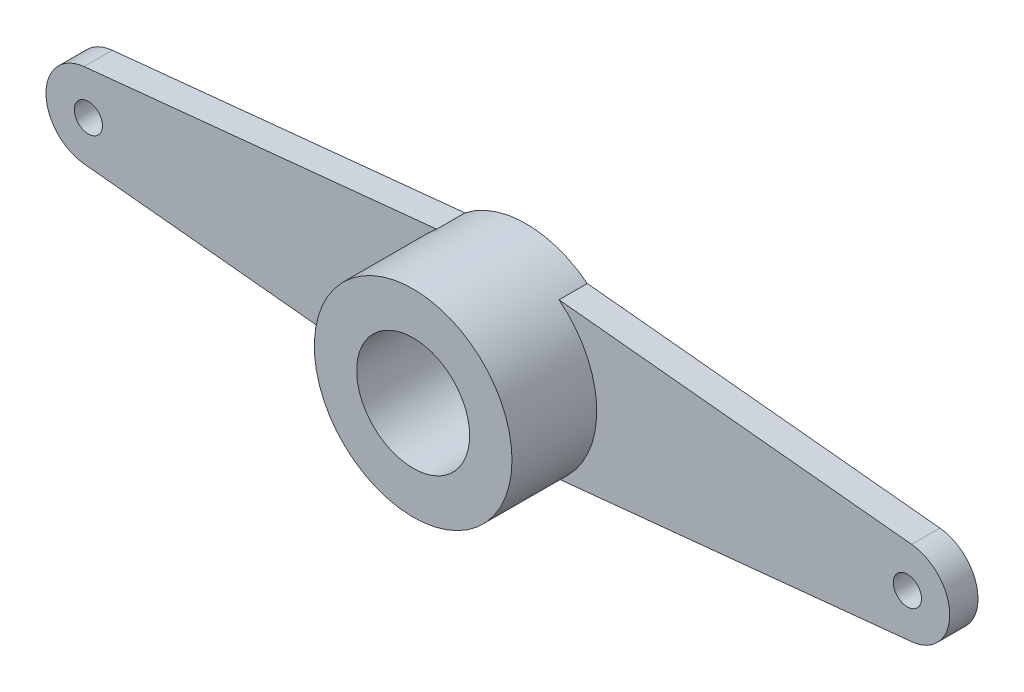
ISO-10303-21;
HEADER;
FILE_DESCRIPTION(('STEP AP214'),'2;1');
FILE_NAME('part.step','',(''),(''),'','','');
FILE_SCHEMA(('AUTOMOTIVE_DESIGN { 1 0 10303 214 1 1 1 1 }'));
ENDSEC;
DATA;
#1=APPLICATION_CONTEXT('core data for automotive mechanical design processes');
#2=APPLICATION_PROTOCOL_DEFINITION('international standard','automotive_design',2000,#1);
#3=PRODUCT_CONTEXT('',#1,'mechanical');
#4=PRODUCT('Part','Part','',(#3));
#5=PRODUCT_RELATED_PRODUCT_CATEGORY('part','',(#4));
#6=PRODUCT_DEFINITION_FORMATION('','',#4);
#7=PRODUCT_DEFINITION_CONTEXT('part definition',#1,'design');
#8=PRODUCT_DEFINITION('design','',#6,#7);
#9=PRODUCT_DEFINITION_SHAPE('','',#8);
#10=(LENGTH_UNIT() NAMED_UNIT(*) SI_UNIT(.MILLI.,.METRE.));
#11=(NAMED_UNIT(*) PLANE_ANGLE_UNIT() SI_UNIT($,.RADIAN.));
#12=(NAMED_UNIT(*) SI_UNIT($,.STERADIAN.) SOLID_ANGLE_UNIT());
#13=UNCERTAINTY_MEASURE_WITH_UNIT(LENGTH_MEASURE(1.E-05),#10,'distance_accuracy_value','');
#14=(GEOMETRIC_REPRESENTATION_CONTEXT(3) GLOBAL_UNCERTAINTY_ASSIGNED_CONTEXT((#13)) GLOBAL_UNIT_ASSIGNED_CONTEXT((#10,
#11,#12)) REPRESENTATION_CONTEXT('',''));
#15=CARTESIAN_POINT('',(0.,0.,0.));
#16=DIRECTION('',(0.,0.,1.));
#17=DIRECTION('',(1.,0.,0.));
#18=AXIS2_PLACEMENT_3D('',#15,#16,#17);
#19=CARTESIAN_POINT('',(0.295950270276392,-2.93826247582225,1.));
#20=DIRECTION('',(-0.100215817025014,0.994965723036733,0.));
#21=DIRECTION('',(-0.994965723036733,-0.100215817025014,0.));
#22=AXIS2_PLACEMENT_3D('',#19,#20,#21);
#23=PLANE('',#22);
#24=DIRECTION('',(0.994965723036733,0.100215817025014,0.));
#25=VECTOR('',#24,1.);
#26=CARTESIAN_POINT('',(0.295950270276392,-2.93826247582225,0.));
#27=LINE('',#26,#25);
#28=CARTESIAN_POINT('',(2.1650635094611,-2.75,0.));
#29=VERTEX_POINT('',#28);
#30=CARTESIAN_POINT('',(14.6503237255375,-1.4924485845551,0.));
#31=VERTEX_POINT('',#30);
#32=EDGE_CURVE('E144',#29,#31,#27,.T.);
#33=ORIENTED_EDGE('',*,*,#32,.T.);
#34=DIRECTION('',(0.,0.,-1.));
#35=VECTOR('',#34,1.);
#36=CARTESIAN_POINT('',(14.6503237255375,-1.4924485845551,1.));
#37=LINE('',#36,#35);
#38=CARTESIAN_POINT('',(14.6503237255375,-1.4924485845551,1.));
#39=VERTEX_POINT('',#38);
#40=EDGE_CURVE('E147',#39,#31,#37,.T.);
#41=ORIENTED_EDGE('',*,*,#40,.F.);
#42=DIRECTION('',(0.994965723036733,0.100215817025014,0.));
#43=VECTOR('',#42,1.);
#44=CARTESIAN_POINT('',(0.295950270276392,-2.93826247582225,1.));
#45=LINE('',#44,#43);
#46=CARTESIAN_POINT('',(2.1650635094611,-2.75,1.));
#47=VERTEX_POINT('',#46);
#48=EDGE_CURVE('E148',#47,#39,#45,.T.);
#49=ORIENTED_EDGE('',*,*,#48,.F.);
#50=DIRECTION('',(0.,0.,-1.));
#51=VECTOR('',#50,1.);
#52=CARTESIAN_POINT('',(2.1650635094611,-2.75,1.));
#53=LINE('',#52,#51);
#54=EDGE_CURVE('E160',#47,#29,#53,.T.);
#55=ORIENTED_EDGE('',*,*,#54,.T.);
#56=EDGE_LOOP('',(#33,#41,#49,#55));
#57=FACE_BOUND('',#56,.T.);
#58=ADVANCED_FACE('F37',(#57),#23,.F.);
#59=CARTESIAN_POINT('',(14.5,0.,1.));
#60=DIRECTION('',(0.,0.,-1.));
#61=DIRECTION('',(-1.,0.,0.));
#62=AXIS2_PLACEMENT_3D('',#59,#60,#61);
#63=CYLINDRICAL_SURFACE('',#62,1.5);
#64=CARTESIAN_POINT('',(14.5,0.,0.));
#65=DIRECTION('',(0.,0.,1.));
#66=DIRECTION('',(1.,0.,0.));
#67=AXIS2_PLACEMENT_3D('',#64,#65,#66);
#68=CIRCLE('',#67,1.5);
#69=CARTESIAN_POINT('',(14.6503237255375,1.4924485845551,0.));
#70=VERTEX_POINT('',#69);
#71=EDGE_CURVE('E163',#31,#70,#68,.T.);
#72=ORIENTED_EDGE('',*,*,#71,.T.);
#73=DIRECTION('',(0.,0.,-1.));
#74=VECTOR('',#73,1.);
#75=CARTESIAN_POINT('',(14.6503237255375,1.4924485845551,1.));
#76=LINE('',#75,#74);
#77=CARTESIAN_POINT('',(14.6503237255375,1.4924485845551,1.));
#78=VERTEX_POINT('',#77);
#79=EDGE_CURVE('E181',#78,#70,#76,.T.);
#80=ORIENTED_EDGE('',*,*,#79,.F.);
#81=CARTESIAN_POINT('',(14.5,0.,1.));
#82=DIRECTION('',(0.,0.,1.));
#83=DIRECTION('',(1.,0.,0.));
#84=AXIS2_PLACEMENT_3D('',#81,#82,#83);
#85=CIRCLE('',#84,1.5);
#86=EDGE_CURVE('E151',#39,#78,#85,.T.);
#87=ORIENTED_EDGE('',*,*,#86,.F.);
#88=ORIENTED_EDGE('',*,*,#40,.T.);
#89=EDGE_LOOP('',(#72,#80,#87,#88));
#90=FACE_BOUND('',#89,.T.);
#91=ADVANCED_FACE('F185',(#90),#63,.T.);
#92=CARTESIAN_POINT('',(0.295950270276392,2.93826247582225,1.));
#93=DIRECTION('',(0.100215817025014,0.994965723036733,0.));
#94=DIRECTION('',(-0.994965723036733,0.100215817025014,0.));
#95=AXIS2_PLACEMENT_3D('',#92,#93,#94);
#96=PLANE('',#95);
#97=DIRECTION('',(0.994965723036733,-0.100215817025014,0.));
#98=VECTOR('',#97,1.);
#99=CARTESIAN_POINT('',(0.295950270276392,2.93826247582225,0.));
#100=LINE('',#99,#98);
#101=CARTESIAN_POINT('',(2.1650635094611,2.75,0.));
#102=VERTEX_POINT('',#101);
#103=EDGE_CURVE('E166',#102,#70,#100,.T.);
#104=ORIENTED_EDGE('',*,*,#103,.F.);
#105=DIRECTION('',(0.,0.,-1.));
#106=VECTOR('',#105,1.);
#107=CARTESIAN_POINT('',(2.1650635094611,2.75,1.));
#108=LINE('',#107,#106);
#109=CARTESIAN_POINT('',(2.1650635094611,2.75,1.));
#110=VERTEX_POINT('',#109);
#111=EDGE_CURVE('E179',#110,#102,#108,.T.);
#112=ORIENTED_EDGE('',*,*,#111,.F.);
#113=DIRECTION('',(0.994965723036733,-0.100215817025014,0.));
#114=VECTOR('',#113,1.);
#115=CARTESIAN_POINT('',(0.295950270276392,2.93826247582225,1.));
#116=LINE('',#115,#114);
#117=EDGE_CURVE('E154',#110,#78,#116,.T.);
#118=ORIENTED_EDGE('',*,*,#117,.T.);
#119=ORIENTED_EDGE('',*,*,#79,.T.);
#120=EDGE_LOOP('',(#104,#112,#118,#119));
#121=FACE_BOUND('',#120,.T.);
#122=ADVANCED_FACE('F198',(#121),#96,.T.);
#123=CARTESIAN_POINT('',(0.,0.,1.));
#124=DIRECTION('',(0.,0.,-1.));
#125=DIRECTION('',(-1.,0.,0.));
#126=AXIS2_PLACEMENT_3D('',#123,#124,#125);
#127=CYLINDRICAL_SURFACE('',#126,2.);
#128=CARTESIAN_POINT('',(0.,0.,4.));
#129=DIRECTION('',(0.,0.,1.));
#130=DIRECTION('',(1.,0.,0.));
#131=AXIS2_PLACEMENT_3D('',#128,#129,#130);
#132=CIRCLE('',#131,2.);
#133=CARTESIAN_POINT('',(2.,0.,4.));
#134=VERTEX_POINT('',#133);
#135=EDGE_CURVE('E138',#134,#134,#132,.T.);
#136=ORIENTED_EDGE('',*,*,#135,.T.);
#137=EDGE_LOOP('',(#136));
#138=FACE_BOUND('',#137,.T.);
#139=CARTESIAN_POINT('',(0.,0.,0.));
#140=DIRECTION('',(0.,0.,1.));
#141=DIRECTION('',(1.,0.,0.));
#142=AXIS2_PLACEMENT_3D('',#139,#140,#141);
#143=CIRCLE('',#142,2.);
#144=CARTESIAN_POINT('',(2.,0.,0.));
#145=VERTEX_POINT('',#144);
#146=EDGE_CURVE('E172',#145,#145,#143,.T.);
#147=ORIENTED_EDGE('',*,*,#146,.F.);
#148=EDGE_LOOP('',(#147));
#149=FACE_BOUND('',#148,.T.);
#150=ADVANCED_FACE('F225',(#138,#149),#127,.F.);
#151=CARTESIAN_POINT('',(0.,0.,1.));
#152=DIRECTION('',(0.,0.,-1.));
#153=DIRECTION('',(-1.,0.,0.));
#154=AXIS2_PLACEMENT_3D('',#151,#152,#153);
#155=CYLINDRICAL_SURFACE('',#154,3.5);
#156=CARTESIAN_POINT('',(0.,0.,1.));
#157=DIRECTION('',(0.,0.,1.));
#158=DIRECTION('',(1.,0.,0.));
#159=AXIS2_PLACEMENT_3D('',#156,#157,#158);
#160=CIRCLE('',#159,3.5);
#161=CARTESIAN_POINT('',(-2.1650635094611,2.75,1.));
#162=VERTEX_POINT('',#161);
#163=CARTESIAN_POINT('',(-2.1650635094611,-2.75,1.));
#164=VERTEX_POINT('',#163);
#165=EDGE_CURVE('E11',#162,#164,#160,.T.);
#166=ORIENTED_EDGE('',*,*,#165,.T.);
#167=DIRECTION('',(0.,0.,-1.));
#168=VECTOR('',#167,1.);
#169=CARTESIAN_POINT('',(-2.1650635094611,-2.75,1.));
#170=LINE('',#169,#168);
#171=CARTESIAN_POINT('',(-2.1650635094611,-2.75,0.));
#172=VERTEX_POINT('',#171);
#173=EDGE_CURVE('E136',#164,#172,#170,.T.);
#174=ORIENTED_EDGE('',*,*,#173,.T.);
#175=CARTESIAN_POINT('',(0.,0.,0.));
#176=DIRECTION('',(0.,0.,1.));
#177=DIRECTION('',(1.,0.,0.));
#178=AXIS2_PLACEMENT_3D('',#175,#176,#177);
#179=CIRCLE('',#178,3.5);
#180=EDGE_CURVE('E169',#172,#29,#179,.T.);
#181=ORIENTED_EDGE('',*,*,#180,.T.);
#182=ORIENTED_EDGE('',*,*,#54,.F.);
#183=CARTESIAN_POINT('',(0.,0.,1.));
#184=DIRECTION('',(0.,0.,1.));
#185=DIRECTION('',(1.,0.,0.));
#186=AXIS2_PLACEMENT_3D('',#183,#184,#185);
#187=CIRCLE('',#186,3.5);
#188=EDGE_CURVE('E44',#47,#110,#187,.T.);
#189=ORIENTED_EDGE('',*,*,#188,.T.);
#190=ORIENTED_EDGE('',*,*,#111,.T.);
#191=CARTESIAN_POINT('',(-2.1650635094611,2.75,0.));
#192=VERTEX_POINT('',#191);
#193=EDGE_CURVE('E170',#102,#192,#179,.T.);
#194=ORIENTED_EDGE('',*,*,#193,.T.);
#195=DIRECTION('',(0.,0.,-1.));
#196=VECTOR('',#195,1.);
#197=CARTESIAN_POINT('',(-2.1650635094611,2.75,1.));
#198=LINE('',#197,#196);
#199=EDGE_CURVE('E54',#162,#192,#198,.T.);
#200=ORIENTED_EDGE('',*,*,#199,.F.);
#201=EDGE_LOOP('',(#166,#174,#181,#182,#189,#190,#194,#200));
#202=FACE_BOUND('',#201,.T.);
#203=CARTESIAN_POINT('',(0.,0.,4.));
#204=DIRECTION('',(0.,0.,1.));
#205=DIRECTION('',(1.,0.,0.));
#206=AXIS2_PLACEMENT_3D('',#203,#204,#205);
#207=CIRCLE('',#206,3.5);
#208=CARTESIAN_POINT('',(3.5,0.,4.));
#209=VERTEX_POINT('',#208);
#210=EDGE_CURVE('E141',#209,#209,#207,.T.);
#211=ORIENTED_EDGE('',*,*,#210,.F.);
#212=EDGE_LOOP('',(#211));
#213=FACE_BOUND('',#212,.T.);
#214=ADVANCED_FACE('F202',(#202,#213),#155,.T.);
#215=CARTESIAN_POINT('',(14.5,0.,1.));
#216=DIRECTION('',(0.,0.,-1.));
#217=DIRECTION('',(-1.,0.,0.));
#218=AXIS2_PLACEMENT_3D('',#215,#216,#217);
#219=CYLINDRICAL_SURFACE('',#218,0.500000000000001);
#220=CARTESIAN_POINT('',(14.5,0.,1.));
#221=DIRECTION('',(0.,0.,1.));
#222=DIRECTION('',(1.,0.,0.));
#223=AXIS2_PLACEMENT_3D('',#220,#221,#222);
#224=CIRCLE('',#223,0.500000000000001);
#225=CARTESIAN_POINT('',(15.,0.,1.));
#226=VERTEX_POINT('',#225);
#227=EDGE_CURVE('E157',#226,#226,#224,.T.);
#228=ORIENTED_EDGE('',*,*,#227,.T.);
#229=EDGE_LOOP('',(#228));
#230=FACE_BOUND('',#229,.T.);
#231=CARTESIAN_POINT('',(14.5,0.,0.));
#232=DIRECTION('',(0.,0.,1.));
#233=DIRECTION('',(1.,0.,0.));
#234=AXIS2_PLACEMENT_3D('',#231,#232,#233);
#235=CIRCLE('',#234,0.500000000000001);
#236=CARTESIAN_POINT('',(15.,0.,0.));
#237=VERTEX_POINT('',#236);
#238=EDGE_CURVE('E152',#237,#237,#235,.T.);
#239=ORIENTED_EDGE('',*,*,#238,.F.);
#240=EDGE_LOOP('',(#239));
#241=FACE_BOUND('',#240,.T.);
#242=ADVANCED_FACE('F230',(#230,#241),#219,.F.);
#243=CARTESIAN_POINT('',(0.,0.,1.));
#244=DIRECTION('',(0.,0.,1.));
#245=DIRECTION('',(1.,0.,0.));
#246=AXIS2_PLACEMENT_3D('',#243,#244,#245);
#247=PLANE('',#246);
#248=ORIENTED_EDGE('',*,*,#188,.F.);
#249=ORIENTED_EDGE('',*,*,#48,.T.);
#250=ORIENTED_EDGE('',*,*,#86,.T.);
#251=ORIENTED_EDGE('',*,*,#117,.F.);
#252=EDGE_LOOP('',(#248,#249,#250,#251));
#253=FACE_BOUND('',#252,.T.);
#254=ORIENTED_EDGE('',*,*,#227,.F.);
#255=EDGE_LOOP('',(#254));
#256=FACE_BOUND('',#255,.T.);
#257=ADVANCED_FACE('F200',(#253,#256),#247,.T.);
#258=CARTESIAN_POINT('',(0.,0.,0.));
#259=DIRECTION('',(0.,0.,1.));
#260=DIRECTION('',(1.,0.,0.));
#261=AXIS2_PLACEMENT_3D('',#258,#259,#260);
#262=PLANE('',#261);
#263=ORIENTED_EDGE('',*,*,#32,.F.);
#264=ORIENTED_EDGE('',*,*,#180,.F.);
#265=DIRECTION('',(-0.994965723036733,0.100215817025014,0.));
#266=VECTOR('',#265,1.);
#267=CARTESIAN_POINT('',(-0.295950270276392,-2.93826247582225,0.));
#268=LINE('',#267,#266);
#269=CARTESIAN_POINT('',(-14.6503237255375,-1.4924485845551,0.));
#270=VERTEX_POINT('',#269);
#271=EDGE_CURVE('E125',#172,#270,#268,.T.);
#272=ORIENTED_EDGE('',*,*,#271,.T.);
#273=CARTESIAN_POINT('',(-14.5,0.,0.));
#274=DIRECTION('',(0.,0.,-1.));
#275=DIRECTION('',(-1.,0.,0.));
#276=AXIS2_PLACEMENT_3D('',#273,#274,#275);
#277=CIRCLE('',#276,1.5);
#278=CARTESIAN_POINT('',(-14.6503237255375,1.4924485845551,0.));
#279=VERTEX_POINT('',#278);
#280=EDGE_CURVE('E129',#270,#279,#277,.T.);
#281=ORIENTED_EDGE('',*,*,#280,.T.);
#282=DIRECTION('',(-0.994965723036733,-0.100215817025014,0.));
#283=VECTOR('',#282,1.);
#284=CARTESIAN_POINT('',(-0.295950270276392,2.93826247582225,0.));
#285=LINE('',#284,#283);
#286=EDGE_CURVE('E111',#192,#279,#285,.T.);
#287=ORIENTED_EDGE('',*,*,#286,.F.);
#288=ORIENTED_EDGE('',*,*,#193,.F.);
#289=ORIENTED_EDGE('',*,*,#103,.T.);
#290=ORIENTED_EDGE('',*,*,#71,.F.);
#291=EDGE_LOOP('',(#263,#264,#272,#281,#287,#288,#289,#290));
#292=FACE_BOUND('',#291,.T.);
#293=ORIENTED_EDGE('',*,*,#238,.T.);
#294=EDGE_LOOP('',(#293));
#295=FACE_BOUND('',#294,.T.);
#296=ORIENTED_EDGE('',*,*,#146,.T.);
#297=EDGE_LOOP('',(#296));
#298=FACE_BOUND('',#297,.T.);
#299=CARTESIAN_POINT('',(-14.5,0.,0.));
#300=DIRECTION('',(0.,0.,-1.));
#301=DIRECTION('',(-1.,0.,0.));
#302=AXIS2_PLACEMENT_3D('',#299,#300,#301);
#303=CIRCLE('',#302,0.500000000000001);
#304=CARTESIAN_POINT('',(-15.,0.,0.));
#305=VERTEX_POINT('',#304);
#306=EDGE_CURVE('E131',#305,#305,#303,.T.);
#307=ORIENTED_EDGE('',*,*,#306,.F.);
#308=EDGE_LOOP('',(#307));
#309=FACE_BOUND('',#308,.T.);
#310=ADVANCED_FACE('F192',(#292,#295,#298,#309),#262,.F.);
#311=CARTESIAN_POINT('',(0.,0.,4.));
#312=DIRECTION('',(0.,0.,1.));
#313=DIRECTION('',(1.,0.,0.));
#314=AXIS2_PLACEMENT_3D('',#311,#312,#313);
#315=PLANE('',#314);
#316=ORIENTED_EDGE('',*,*,#210,.T.);
#317=EDGE_LOOP('',(#316));
#318=FACE_BOUND('',#317,.T.);
#319=ORIENTED_EDGE('',*,*,#135,.F.);
#320=EDGE_LOOP('',(#319));
#321=FACE_BOUND('',#320,.T.);
#322=ADVANCED_FACE('F214',(#318,#321),#315,.T.);
#323=CARTESIAN_POINT('',(0.,0.,1.));
#324=DIRECTION('',(0.,0.,1.));
#325=DIRECTION('',(-1.,0.,0.));
#326=AXIS2_PLACEMENT_3D('',#323,#324,#325);
#327=PLANE('',#326);
#328=CARTESIAN_POINT('',(-14.5,0.,1.));
#329=DIRECTION('',(0.,0.,-1.));
#330=DIRECTION('',(-1.,0.,0.));
#331=AXIS2_PLACEMENT_3D('',#328,#329,#330);
#332=CIRCLE('',#331,0.500000000000001);
#333=CARTESIAN_POINT('',(-15.,0.,1.));
#334=VERTEX_POINT('',#333);
#335=EDGE_CURVE('E119',#334,#334,#332,.T.);
#336=ORIENTED_EDGE('',*,*,#335,.T.);
#337=EDGE_LOOP('',(#336));
#338=FACE_BOUND('',#337,.T.);
#339=ORIENTED_EDGE('',*,*,#165,.F.);
#340=DIRECTION('',(-0.994965723036733,-0.100215817025014,0.));
#341=VECTOR('',#340,1.);
#342=CARTESIAN_POINT('',(-0.295950270276392,2.93826247582225,1.));
#343=LINE('',#342,#341);
#344=CARTESIAN_POINT('',(-14.6503237255375,1.4924485845551,1.));
#345=VERTEX_POINT('',#344);
#346=EDGE_CURVE('E98',#162,#345,#343,.T.);
#347=ORIENTED_EDGE('',*,*,#346,.T.);
#348=CARTESIAN_POINT('',(-14.5,0.,1.));
#349=DIRECTION('',(0.,0.,-1.));
#350=DIRECTION('',(-1.,0.,0.));
#351=AXIS2_PLACEMENT_3D('',#348,#349,#350);
#352=CIRCLE('',#351,1.5);
#353=CARTESIAN_POINT('',(-14.6503237255375,-1.4924485845551,1.));
#354=VERTEX_POINT('',#353);
#355=EDGE_CURVE('E103',#354,#345,#352,.T.);
#356=ORIENTED_EDGE('',*,*,#355,.F.);
#357=DIRECTION('',(-0.994965723036733,0.100215817025014,0.));
#358=VECTOR('',#357,1.);
#359=CARTESIAN_POINT('',(-0.295950270276392,-2.93826247582225,1.));
#360=LINE('',#359,#358);
#361=EDGE_CURVE('E105',#164,#354,#360,.T.);
#362=ORIENTED_EDGE('',*,*,#361,.F.);
#363=EDGE_LOOP('',(#339,#347,#356,#362));
#364=FACE_BOUND('',#363,.T.);
#365=ADVANCED_FACE('F100',(#338,#364),#327,.T.);
#366=CARTESIAN_POINT('',(-0.295950270276392,-2.93826247582225,1.));
#367=DIRECTION('',(-0.100215817025014,-0.994965723036733,0.));
#368=DIRECTION('',(0.994965723036733,-0.100215817025014,0.));
#369=AXIS2_PLACEMENT_3D('',#366,#367,#368);
#370=PLANE('',#369);
#371=ORIENTED_EDGE('',*,*,#271,.F.);
#372=ORIENTED_EDGE('',*,*,#173,.F.);
#373=ORIENTED_EDGE('',*,*,#361,.T.);
#374=DIRECTION('',(0.,0.,-1.));
#375=VECTOR('',#374,1.);
#376=CARTESIAN_POINT('',(-14.6503237255375,-1.4924485845551,1.));
#377=LINE('',#376,#375);
#378=EDGE_CURVE('E115',#354,#270,#377,.T.);
#379=ORIENTED_EDGE('',*,*,#378,.T.);
#380=EDGE_LOOP('',(#371,#372,#373,#379));
#381=FACE_BOUND('',#380,.T.);
#382=ADVANCED_FACE('F206',(#381),#370,.T.);
#383=CARTESIAN_POINT('',(-0.295950270276392,2.93826247582225,1.));
#384=DIRECTION('',(0.100215817025014,-0.994965723036733,0.));
#385=DIRECTION('',(0.994965723036733,0.100215817025014,0.));
#386=AXIS2_PLACEMENT_3D('',#383,#384,#385);
#387=PLANE('',#386);
#388=ORIENTED_EDGE('',*,*,#286,.T.);
#389=DIRECTION('',(0.,0.,-1.));
#390=VECTOR('',#389,1.);
#391=CARTESIAN_POINT('',(-14.6503237255375,1.4924485845551,1.));
#392=LINE('',#391,#390);
#393=EDGE_CURVE('E108',#345,#279,#392,.T.);
#394=ORIENTED_EDGE('',*,*,#393,.F.);
#395=ORIENTED_EDGE('',*,*,#346,.F.);
#396=ORIENTED_EDGE('',*,*,#199,.T.);
#397=EDGE_LOOP('',(#388,#394,#395,#396));
#398=FACE_BOUND('',#397,.T.);
#399=ADVANCED_FACE('F109',(#398),#387,.F.);
#400=CARTESIAN_POINT('',(-14.5,0.,1.));
#401=DIRECTION('',(0.,0.,-1.));
#402=DIRECTION('',(-1.,0.,0.));
#403=AXIS2_PLACEMENT_3D('',#400,#401,#402);
#404=CYLINDRICAL_SURFACE('',#403,1.5);
#405=ORIENTED_EDGE('',*,*,#280,.F.);
#406=ORIENTED_EDGE('',*,*,#378,.F.);
#407=ORIENTED_EDGE('',*,*,#355,.T.);
#408=ORIENTED_EDGE('',*,*,#393,.T.);
#409=EDGE_LOOP('',(#405,#406,#407,#408));
#410=FACE_BOUND('',#409,.T.);
#411=ADVANCED_FACE('F117',(#410),#404,.T.);
#412=CARTESIAN_POINT('',(-14.5,0.,1.));
#413=DIRECTION('',(0.,0.,-1.));
#414=DIRECTION('',(-1.,0.,0.));
#415=AXIS2_PLACEMENT_3D('',#412,#413,#414);
#416=CYLINDRICAL_SURFACE('',#415,0.500000000000001);
#417=ORIENTED_EDGE('',*,*,#335,.F.);
#418=EDGE_LOOP('',(#417));
#419=FACE_BOUND('',#418,.T.);
#420=ORIENTED_EDGE('',*,*,#306,.T.);
#421=EDGE_LOOP('',(#420));
#422=FACE_BOUND('',#421,.T.);
#423=ADVANCED_FACE('F253',(#419,#422),#416,.F.);
#424=CLOSED_SHELL('',(#58,#91,#122,#150,#214,#242,#257,#310,#322,#365,#382,#399,#411,#423));
#425=MANIFOLD_SOLID_BREP('B2',#424);
#426=ADVANCED_BREP_SHAPE_REPRESENTATION('',(#18,#425),#14);
#427=SHAPE_DEFINITION_REPRESENTATION(#9,#426);
ENDSEC;
END-ISO-10303-21;
